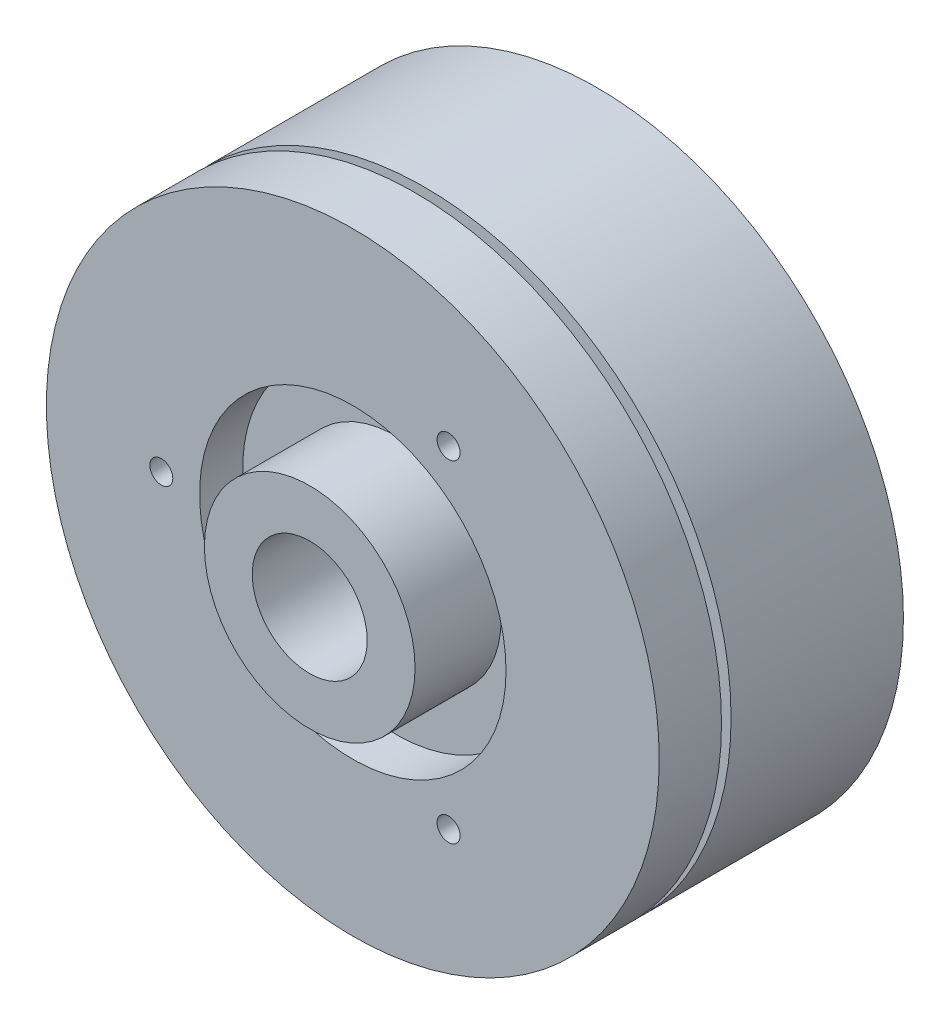
ISO-10303-21;
HEADER;
FILE_DESCRIPTION(('STEP AP214'),'2;1');
FILE_NAME('part.step','',(''),(''),'','','');
FILE_SCHEMA(('AUTOMOTIVE_DESIGN { 1 0 10303 214 1 1 1 1 }'));
ENDSEC;
DATA;
#1=APPLICATION_CONTEXT('core data for automotive mechanical design processes');
#2=APPLICATION_PROTOCOL_DEFINITION('international standard','automotive_design',2000,#1);
#3=PRODUCT_CONTEXT('',#1,'mechanical');
#4=PRODUCT('Part','Part','',(#3));
#5=PRODUCT_RELATED_PRODUCT_CATEGORY('part','',(#4));
#6=PRODUCT_DEFINITION_FORMATION('','',#4);
#7=PRODUCT_DEFINITION_CONTEXT('part definition',#1,'design');
#8=PRODUCT_DEFINITION('design','',#6,#7);
#9=PRODUCT_DEFINITION_SHAPE('','',#8);
#10=(LENGTH_UNIT() NAMED_UNIT(*) SI_UNIT(.MILLI.,.METRE.));
#11=(NAMED_UNIT(*) PLANE_ANGLE_UNIT() SI_UNIT($,.RADIAN.));
#12=(NAMED_UNIT(*) SI_UNIT($,.STERADIAN.) SOLID_ANGLE_UNIT());
#13=UNCERTAINTY_MEASURE_WITH_UNIT(LENGTH_MEASURE(1.E-05),#10,'distance_accuracy_value','');
#14=(GEOMETRIC_REPRESENTATION_CONTEXT(3) GLOBAL_UNCERTAINTY_ASSIGNED_CONTEXT((#13)) GLOBAL_UNIT_ASSIGNED_CONTEXT((#10,
#11,#12)) REPRESENTATION_CONTEXT('',''));
#15=CARTESIAN_POINT('',(0.,0.,0.));
#16=DIRECTION('',(0.,0.,1.));
#17=DIRECTION('',(1.,0.,0.));
#18=AXIS2_PLACEMENT_3D('',#15,#16,#17);
#19=CARTESIAN_POINT('',(0.,0.,9.));
#20=DIRECTION('',(0.,0.,-1.));
#21=DIRECTION('',(-1.,0.,0.));
#22=AXIS2_PLACEMENT_3D('',#19,#20,#21);
#23=CYLINDRICAL_SURFACE('',#22,16.);
#24=CARTESIAN_POINT('',(0.,0.,9.));
#25=DIRECTION('',(0.,0.,1.));
#26=DIRECTION('',(1.,0.,0.));
#27=AXIS2_PLACEMENT_3D('',#24,#25,#26);
#28=CIRCLE('',#27,16.);
#29=CARTESIAN_POINT('',(16.,0.,9.));
#30=VERTEX_POINT('',#29);
#31=EDGE_CURVE('E44',#30,#30,#28,.T.);
#32=ORIENTED_EDGE('',*,*,#31,.F.);
#33=EDGE_LOOP('',(#32));
#34=FACE_BOUND('',#33,.T.);
#35=CARTESIAN_POINT('',(0.,0.,0.));
#36=DIRECTION('',(0.,0.,1.));
#37=DIRECTION('',(1.,0.,0.));
#38=AXIS2_PLACEMENT_3D('',#35,#36,#37);
#39=CIRCLE('',#38,16.);
#40=CARTESIAN_POINT('',(16.,0.,0.));
#41=VERTEX_POINT('',#40);
#42=EDGE_CURVE('E39',#41,#41,#39,.T.);
#43=ORIENTED_EDGE('',*,*,#42,.T.);
#44=EDGE_LOOP('',(#43));
#45=FACE_BOUND('',#44,.T.);
#46=ADVANCED_FACE('F36',(#34,#45),#23,.T.);
#47=CARTESIAN_POINT('',(0.,0.,9.));
#48=DIRECTION('',(0.,0.,1.));
#49=DIRECTION('',(1.,0.,0.));
#50=AXIS2_PLACEMENT_3D('',#47,#48,#49);
#51=PLANE('',#50);
#52=CARTESIAN_POINT('',(0.,0.,9.));
#53=DIRECTION('',(0.,0.,1.));
#54=DIRECTION('',(1.,0.,0.));
#55=AXIS2_PLACEMENT_3D('',#52,#53,#54);
#56=CIRCLE('',#55,6.);
#57=CARTESIAN_POINT('',(6.,0.,9.));
#58=VERTEX_POINT('',#57);
#59=EDGE_CURVE('E10',#58,#58,#56,.T.);
#60=ORIENTED_EDGE('',*,*,#59,.F.);
#61=EDGE_LOOP('',(#60));
#62=FACE_BOUND('',#61,.T.);
#63=ORIENTED_EDGE('',*,*,#31,.T.);
#64=EDGE_LOOP('',(#63));
#65=FACE_BOUND('',#64,.T.);
#66=ADVANCED_FACE('F177',(#62,#65),#51,.T.);
#67=CARTESIAN_POINT('',(0.,0.,0.));
#68=DIRECTION('',(0.,0.,1.));
#69=DIRECTION('',(1.,0.,0.));
#70=AXIS2_PLACEMENT_3D('',#67,#68,#69);
#71=PLANE('',#70);
#72=CARTESIAN_POINT('',(-8.66025403784438,5.00000000000001,0.));
#73=DIRECTION('',(0.,0.,-1.));
#74=DIRECTION('',(-1.,0.,0.));
#75=AXIS2_PLACEMENT_3D('',#72,#73,#74);
#76=CIRCLE('',#75,0.6);
#77=CARTESIAN_POINT('',(-9.26025403784438,5.00000000000001,0.));
#78=VERTEX_POINT('',#77);
#79=EDGE_CURVE('E105',#78,#78,#76,.T.);
#80=ORIENTED_EDGE('',*,*,#79,.F.);
#81=EDGE_LOOP('',(#80));
#82=FACE_BOUND('',#81,.T.);
#83=CARTESIAN_POINT('',(8.66025403784442,4.99999999999995,0.));
#84=DIRECTION('',(0.,0.,-1.));
#85=DIRECTION('',(-1.,0.,0.));
#86=AXIS2_PLACEMENT_3D('',#83,#84,#85);
#87=CIRCLE('',#86,0.6);
#88=CARTESIAN_POINT('',(8.06025403784442,4.99999999999995,0.));
#89=VERTEX_POINT('',#88);
#90=EDGE_CURVE('E97',#89,#89,#87,.T.);
#91=ORIENTED_EDGE('',*,*,#90,.F.);
#92=EDGE_LOOP('',(#91));
#93=FACE_BOUND('',#92,.T.);
#94=CARTESIAN_POINT('',(0.,-10.,0.));
#95=DIRECTION('',(0.,0.,-1.));
#96=DIRECTION('',(-1.,0.,0.));
#97=AXIS2_PLACEMENT_3D('',#94,#95,#96);
#98=CIRCLE('',#97,0.6);
#99=CARTESIAN_POINT('',(-0.6,-10.,0.));
#100=VERTEX_POINT('',#99);
#101=EDGE_CURVE('E88',#100,#100,#98,.T.);
#102=ORIENTED_EDGE('',*,*,#101,.F.);
#103=EDGE_LOOP('',(#102));
#104=FACE_BOUND('',#103,.T.);
#105=CARTESIAN_POINT('',(0.,0.,0.));
#106=DIRECTION('',(0.,0.,1.));
#107=DIRECTION('',(1.,0.,0.));
#108=AXIS2_PLACEMENT_3D('',#105,#106,#107);
#109=CIRCLE('',#108,3.);
#110=CARTESIAN_POINT('',(3.,0.,0.));
#111=VERTEX_POINT('',#110);
#112=EDGE_CURVE('E67',#111,#111,#109,.T.);
#113=ORIENTED_EDGE('',*,*,#112,.T.);
#114=EDGE_LOOP('',(#113));
#115=FACE_BOUND('',#114,.T.);
#116=ORIENTED_EDGE('',*,*,#42,.F.);
#117=EDGE_LOOP('',(#116));
#118=FACE_BOUND('',#117,.T.);
#119=ADVANCED_FACE('F182',(#82,#93,#104,#115,#118),#71,.F.);
#120=CARTESIAN_POINT('',(0.,0.,9.5));
#121=DIRECTION('',(0.,0.,-1.));
#122=DIRECTION('',(-1.,0.,0.));
#123=AXIS2_PLACEMENT_3D('',#120,#121,#122);
#124=CYLINDRICAL_SURFACE('',#123,6.);
#125=CARTESIAN_POINT('',(0.,0.,9.5));
#126=DIRECTION('',(0.,0.,1.));
#127=DIRECTION('',(1.,0.,0.));
#128=AXIS2_PLACEMENT_3D('',#125,#126,#127);
#129=CIRCLE('',#128,6.);
#130=CARTESIAN_POINT('',(6.,0.,9.5));
#131=VERTEX_POINT('',#130);
#132=EDGE_CURVE('E51',#131,#131,#129,.T.);
#133=ORIENTED_EDGE('',*,*,#132,.F.);
#134=EDGE_LOOP('',(#133));
#135=FACE_BOUND('',#134,.T.);
#136=ORIENTED_EDGE('',*,*,#59,.T.);
#137=EDGE_LOOP('',(#136));
#138=FACE_BOUND('',#137,.T.);
#139=ADVANCED_FACE('F161',(#135,#138),#124,.T.);
#140=CARTESIAN_POINT('',(0.,0.,12.75));
#141=DIRECTION('',(0.,0.,-1.));
#142=DIRECTION('',(-1.,0.,0.));
#143=AXIS2_PLACEMENT_3D('',#140,#141,#142);
#144=CYLINDRICAL_SURFACE('',#143,16.);
#145=CARTESIAN_POINT('',(0.,0.,12.75));
#146=DIRECTION('',(0.,0.,1.));
#147=DIRECTION('',(1.,0.,0.));
#148=AXIS2_PLACEMENT_3D('',#145,#146,#147);
#149=CIRCLE('',#148,16.);
#150=CARTESIAN_POINT('',(16.,0.,12.75));
#151=VERTEX_POINT('',#150);
#152=EDGE_CURVE('E55',#151,#151,#149,.T.);
#153=ORIENTED_EDGE('',*,*,#152,.F.);
#154=EDGE_LOOP('',(#153));
#155=FACE_BOUND('',#154,.T.);
#156=CARTESIAN_POINT('',(0.,0.,9.5));
#157=DIRECTION('',(0.,0.,1.));
#158=DIRECTION('',(1.,0.,0.));
#159=AXIS2_PLACEMENT_3D('',#156,#157,#158);
#160=CIRCLE('',#159,16.);
#161=CARTESIAN_POINT('',(16.,0.,9.5));
#162=VERTEX_POINT('',#161);
#163=EDGE_CURVE('E56',#162,#162,#160,.T.);
#164=ORIENTED_EDGE('',*,*,#163,.T.);
#165=EDGE_LOOP('',(#164));
#166=FACE_BOUND('',#165,.T.);
#167=ADVANCED_FACE('F149',(#155,#166),#144,.T.);
#168=CARTESIAN_POINT('',(0.,0.,12.75));
#169=DIRECTION('',(0.,0.,1.));
#170=DIRECTION('',(1.,0.,0.));
#171=AXIS2_PLACEMENT_3D('',#168,#169,#170);
#172=PLANE('',#171);
#173=CARTESIAN_POINT('',(4.99999999999998,-8.6602540378444,12.75));
#174=DIRECTION('',(0.,0.,1.));
#175=DIRECTION('',(1.,0.,0.));
#176=AXIS2_PLACEMENT_3D('',#173,#174,#175);
#177=CIRCLE('',#176,0.6);
#178=CARTESIAN_POINT('',(5.59999999999998,-8.6602540378444,12.75));
#179=VERTEX_POINT('',#178);
#180=EDGE_CURVE('E128',#179,#179,#177,.T.);
#181=ORIENTED_EDGE('',*,*,#180,.F.);
#182=EDGE_LOOP('',(#181));
#183=FACE_BOUND('',#182,.T.);
#184=CARTESIAN_POINT('',(4.99999999999998,8.6602540378444,12.75));
#185=DIRECTION('',(0.,0.,1.));
#186=DIRECTION('',(1.,0.,0.));
#187=AXIS2_PLACEMENT_3D('',#184,#185,#186);
#188=CIRCLE('',#187,0.6);
#189=CARTESIAN_POINT('',(5.59999999999998,8.6602540378444,12.75));
#190=VERTEX_POINT('',#189);
#191=EDGE_CURVE('E120',#190,#190,#188,.T.);
#192=ORIENTED_EDGE('',*,*,#191,.F.);
#193=EDGE_LOOP('',(#192));
#194=FACE_BOUND('',#193,.T.);
#195=CARTESIAN_POINT('',(-10.,0.,12.75));
#196=DIRECTION('',(0.,0.,1.));
#197=DIRECTION('',(1.,0.,0.));
#198=AXIS2_PLACEMENT_3D('',#195,#196,#197);
#199=CIRCLE('',#198,0.6);
#200=CARTESIAN_POINT('',(-9.4,0.,12.75));
#201=VERTEX_POINT('',#200);
#202=EDGE_CURVE('E112',#201,#201,#199,.T.);
#203=ORIENTED_EDGE('',*,*,#202,.F.);
#204=EDGE_LOOP('',(#203));
#205=FACE_BOUND('',#204,.T.);
#206=CARTESIAN_POINT('',(0.,0.,12.75));
#207=DIRECTION('',(0.,0.,1.));
#208=DIRECTION('',(1.,0.,0.));
#209=AXIS2_PLACEMENT_3D('',#206,#207,#208);
#210=CIRCLE('',#209,8.);
#211=CARTESIAN_POINT('',(8.,0.,12.75));
#212=VERTEX_POINT('',#211);
#213=EDGE_CURVE('E76',#212,#212,#210,.T.);
#214=ORIENTED_EDGE('',*,*,#213,.F.);
#215=EDGE_LOOP('',(#214));
#216=FACE_BOUND('',#215,.T.);
#217=ORIENTED_EDGE('',*,*,#152,.T.);
#218=EDGE_LOOP('',(#217));
#219=FACE_BOUND('',#218,.T.);
#220=ADVANCED_FACE('F145',(#183,#194,#205,#216,#219),#172,.T.);
#221=CARTESIAN_POINT('',(0.,0.,9.5));
#222=DIRECTION('',(0.,0.,1.));
#223=DIRECTION('',(1.,0.,0.));
#224=AXIS2_PLACEMENT_3D('',#221,#222,#223);
#225=PLANE('',#224);
#226=ORIENTED_EDGE('',*,*,#132,.T.);
#227=EDGE_LOOP('',(#226));
#228=FACE_BOUND('',#227,.T.);
#229=ORIENTED_EDGE('',*,*,#163,.F.);
#230=EDGE_LOOP('',(#229));
#231=FACE_BOUND('',#230,.T.);
#232=ADVANCED_FACE('F148',(#228,#231),#225,.F.);
#233=CARTESIAN_POINT('',(0.,0.,15.));
#234=DIRECTION('',(0.,0.,-1.));
#235=DIRECTION('',(-1.,0.,0.));
#236=AXIS2_PLACEMENT_3D('',#233,#234,#235);
#237=CYLINDRICAL_SURFACE('',#236,5.5);
#238=CARTESIAN_POINT('',(0.,0.,15.));
#239=DIRECTION('',(0.,0.,1.));
#240=DIRECTION('',(1.,0.,0.));
#241=AXIS2_PLACEMENT_3D('',#238,#239,#240);
#242=CIRCLE('',#241,5.5);
#243=CARTESIAN_POINT('',(5.5,0.,15.));
#244=VERTEX_POINT('',#243);
#245=EDGE_CURVE('E60',#244,#244,#242,.T.);
#246=ORIENTED_EDGE('',*,*,#245,.F.);
#247=EDGE_LOOP('',(#246));
#248=FACE_BOUND('',#247,.T.);
#249=CARTESIAN_POINT('',(0.,0.,10.5));
#250=DIRECTION('',(0.,0.,1.));
#251=DIRECTION('',(1.,0.,0.));
#252=AXIS2_PLACEMENT_3D('',#249,#250,#251);
#253=CIRCLE('',#252,5.5);
#254=CARTESIAN_POINT('',(5.5,0.,10.5));
#255=VERTEX_POINT('',#254);
#256=EDGE_CURVE('E80',#255,#255,#253,.T.);
#257=ORIENTED_EDGE('',*,*,#256,.T.);
#258=EDGE_LOOP('',(#257));
#259=FACE_BOUND('',#258,.T.);
#260=ADVANCED_FACE('F166',(#248,#259),#237,.T.);
#261=CARTESIAN_POINT('',(0.,0.,15.));
#262=DIRECTION('',(0.,0.,1.));
#263=DIRECTION('',(1.,0.,0.));
#264=AXIS2_PLACEMENT_3D('',#261,#262,#263);
#265=PLANE('',#264);
#266=CARTESIAN_POINT('',(0.,0.,15.));
#267=DIRECTION('',(0.,0.,1.));
#268=DIRECTION('',(1.,0.,0.));
#269=AXIS2_PLACEMENT_3D('',#266,#267,#268);
#270=CIRCLE('',#269,3.);
#271=CARTESIAN_POINT('',(3.,0.,15.));
#272=VERTEX_POINT('',#271);
#273=EDGE_CURVE('E71',#272,#272,#270,.T.);
#274=ORIENTED_EDGE('',*,*,#273,.F.);
#275=EDGE_LOOP('',(#274));
#276=FACE_BOUND('',#275,.T.);
#277=ORIENTED_EDGE('',*,*,#245,.T.);
#278=EDGE_LOOP('',(#277));
#279=FACE_BOUND('',#278,.T.);
#280=ADVANCED_FACE('F173',(#276,#279),#265,.T.);
#281=CARTESIAN_POINT('',(0.,0.,-11.25));
#282=DIRECTION('',(0.,0.,1.));
#283=DIRECTION('',(1.,0.,0.));
#284=AXIS2_PLACEMENT_3D('',#281,#282,#283);
#285=CYLINDRICAL_SURFACE('',#284,3.);
#286=ORIENTED_EDGE('',*,*,#273,.T.);
#287=EDGE_LOOP('',(#286));
#288=FACE_BOUND('',#287,.T.);
#289=ORIENTED_EDGE('',*,*,#112,.F.);
#290=EDGE_LOOP('',(#289));
#291=FACE_BOUND('',#290,.T.);
#292=ADVANCED_FACE('F208',(#288,#291),#285,.F.);
#293=CARTESIAN_POINT('',(0.,0.,10.5));
#294=DIRECTION('',(0.,0.,1.));
#295=DIRECTION('',(1.,0.,0.));
#296=AXIS2_PLACEMENT_3D('',#293,#294,#295);
#297=CYLINDRICAL_SURFACE('',#296,8.);
#298=CARTESIAN_POINT('',(0.,0.,10.5));
#299=DIRECTION('',(0.,0.,1.));
#300=DIRECTION('',(1.,0.,0.));
#301=AXIS2_PLACEMENT_3D('',#298,#299,#300);
#302=CIRCLE('',#301,8.);
#303=CARTESIAN_POINT('',(8.,0.,10.5));
#304=VERTEX_POINT('',#303);
#305=EDGE_CURVE('E75',#304,#304,#302,.T.);
#306=ORIENTED_EDGE('',*,*,#305,.F.);
#307=EDGE_LOOP('',(#306));
#308=FACE_BOUND('',#307,.T.);
#309=ORIENTED_EDGE('',*,*,#213,.T.);
#310=EDGE_LOOP('',(#309));
#311=FACE_BOUND('',#310,.T.);
#312=ADVANCED_FACE('F210',(#308,#311),#297,.F.);
#313=CARTESIAN_POINT('',(0.,0.,10.5));
#314=DIRECTION('',(0.,0.,1.));
#315=DIRECTION('',(1.,0.,0.));
#316=AXIS2_PLACEMENT_3D('',#313,#314,#315);
#317=PLANE('',#316);
#318=ORIENTED_EDGE('',*,*,#256,.F.);
#319=EDGE_LOOP('',(#318));
#320=FACE_BOUND('',#319,.T.);
#321=ORIENTED_EDGE('',*,*,#305,.T.);
#322=EDGE_LOOP('',(#321));
#323=FACE_BOUND('',#322,.T.);
#324=ADVANCED_FACE('F217',(#320,#323),#317,.T.);
#325=CARTESIAN_POINT('',(0.,-10.,6.));
#326=DIRECTION('',(0.,0.,-1.));
#327=DIRECTION('',(-1.,0.,0.));
#328=AXIS2_PLACEMENT_3D('',#325,#326,#327);
#329=CYLINDRICAL_SURFACE('',#328,0.6);
#330=CARTESIAN_POINT('',(0.,-10.,6.));
#331=DIRECTION('',(0.,0.,-1.));
#332=DIRECTION('',(-1.,0.,0.));
#333=AXIS2_PLACEMENT_3D('',#330,#331,#332);
#334=CIRCLE('',#333,0.6);
#335=CARTESIAN_POINT('',(-0.6,-10.,6.));
#336=VERTEX_POINT('',#335);
#337=EDGE_CURVE('E92',#336,#336,#334,.T.);
#338=ORIENTED_EDGE('',*,*,#337,.F.);
#339=EDGE_LOOP('',(#338));
#340=FACE_BOUND('',#339,.T.);
#341=ORIENTED_EDGE('',*,*,#101,.T.);
#342=EDGE_LOOP('',(#341));
#343=FACE_BOUND('',#342,.T.);
#344=ADVANCED_FACE('F225',(#340,#343),#329,.F.);
#345=CARTESIAN_POINT('',(0.,-10.,6.));
#346=DIRECTION('',(0.,0.,-1.));
#347=DIRECTION('',(-1.,0.,0.));
#348=AXIS2_PLACEMENT_3D('',#345,#346,#347);
#349=PLANE('',#348);
#350=ORIENTED_EDGE('',*,*,#337,.T.);
#351=EDGE_LOOP('',(#350));
#352=FACE_BOUND('',#351,.T.);
#353=ADVANCED_FACE('F229',(#352),#349,.T.);
#354=CARTESIAN_POINT('',(8.66025403784442,4.99999999999995,6.));
#355=DIRECTION('',(0.,0.,-1.));
#356=DIRECTION('',(-1.,0.,0.));
#357=AXIS2_PLACEMENT_3D('',#354,#355,#356);
#358=CYLINDRICAL_SURFACE('',#357,0.6);
#359=CARTESIAN_POINT('',(8.66025403784442,4.99999999999995,6.));
#360=DIRECTION('',(0.,0.,-1.));
#361=DIRECTION('',(-1.,0.,0.));
#362=AXIS2_PLACEMENT_3D('',#359,#360,#361);
#363=CIRCLE('',#362,0.6);
#364=CARTESIAN_POINT('',(8.06025403784442,4.99999999999995,6.));
#365=VERTEX_POINT('',#364);
#366=EDGE_CURVE('E101',#365,#365,#363,.T.);
#367=ORIENTED_EDGE('',*,*,#366,.F.);
#368=EDGE_LOOP('',(#367));
#369=FACE_BOUND('',#368,.T.);
#370=ORIENTED_EDGE('',*,*,#90,.T.);
#371=EDGE_LOOP('',(#370));
#372=FACE_BOUND('',#371,.T.);
#373=ADVANCED_FACE('F233',(#369,#372),#358,.F.);
#374=CARTESIAN_POINT('',(8.66025403784442,4.99999999999995,6.));
#375=DIRECTION('',(0.,0.,-1.));
#376=DIRECTION('',(-1.,0.,0.));
#377=AXIS2_PLACEMENT_3D('',#374,#375,#376);
#378=PLANE('',#377);
#379=ORIENTED_EDGE('',*,*,#366,.T.);
#380=EDGE_LOOP('',(#379));
#381=FACE_BOUND('',#380,.T.);
#382=ADVANCED_FACE('F237',(#381),#378,.T.);
#383=CARTESIAN_POINT('',(-8.66025403784438,5.00000000000001,6.));
#384=DIRECTION('',(0.,0.,-1.));
#385=DIRECTION('',(-1.,0.,0.));
#386=AXIS2_PLACEMENT_3D('',#383,#384,#385);
#387=CYLINDRICAL_SURFACE('',#386,0.6);
#388=CARTESIAN_POINT('',(-8.66025403784438,5.00000000000001,6.));
#389=DIRECTION('',(0.,0.,-1.));
#390=DIRECTION('',(-1.,0.,0.));
#391=AXIS2_PLACEMENT_3D('',#388,#389,#390);
#392=CIRCLE('',#391,0.6);
#393=CARTESIAN_POINT('',(-9.26025403784438,5.00000000000001,6.));
#394=VERTEX_POINT('',#393);
#395=EDGE_CURVE('E87',#394,#394,#392,.T.);
#396=ORIENTED_EDGE('',*,*,#395,.F.);
#397=EDGE_LOOP('',(#396));
#398=FACE_BOUND('',#397,.T.);
#399=ORIENTED_EDGE('',*,*,#79,.T.);
#400=EDGE_LOOP('',(#399));
#401=FACE_BOUND('',#400,.T.);
#402=ADVANCED_FACE('F241',(#398,#401),#387,.F.);
#403=CARTESIAN_POINT('',(-8.66025403784438,5.00000000000001,6.));
#404=DIRECTION('',(0.,0.,-1.));
#405=DIRECTION('',(-1.,0.,0.));
#406=AXIS2_PLACEMENT_3D('',#403,#404,#405);
#407=PLANE('',#406);
#408=ORIENTED_EDGE('',*,*,#395,.T.);
#409=EDGE_LOOP('',(#408));
#410=FACE_BOUND('',#409,.T.);
#411=ADVANCED_FACE('F245',(#410),#407,.T.);
#412=CARTESIAN_POINT('',(-10.,0.,9.75));
#413=DIRECTION('',(0.,0.,1.));
#414=DIRECTION('',(1.,0.,0.));
#415=AXIS2_PLACEMENT_3D('',#412,#413,#414);
#416=CYLINDRICAL_SURFACE('',#415,0.6);
#417=CARTESIAN_POINT('',(-10.,0.,9.75));
#418=DIRECTION('',(0.,0.,1.));
#419=DIRECTION('',(1.,0.,0.));
#420=AXIS2_PLACEMENT_3D('',#417,#418,#419);
#421=CIRCLE('',#420,0.6);
#422=CARTESIAN_POINT('',(-9.4,0.,9.75));
#423=VERTEX_POINT('',#422);
#424=EDGE_CURVE('E116',#423,#423,#421,.T.);
#425=ORIENTED_EDGE('',*,*,#424,.F.);
#426=EDGE_LOOP('',(#425));
#427=FACE_BOUND('',#426,.T.);
#428=ORIENTED_EDGE('',*,*,#202,.T.);
#429=EDGE_LOOP('',(#428));
#430=FACE_BOUND('',#429,.T.);
#431=ADVANCED_FACE('F249',(#427,#430),#416,.F.);
#432=CARTESIAN_POINT('',(-10.,0.,9.75));
#433=DIRECTION('',(0.,0.,1.));
#434=DIRECTION('',(1.,0.,0.));
#435=AXIS2_PLACEMENT_3D('',#432,#433,#434);
#436=PLANE('',#435);
#437=ORIENTED_EDGE('',*,*,#424,.T.);
#438=EDGE_LOOP('',(#437));
#439=FACE_BOUND('',#438,.T.);
#440=ADVANCED_FACE('F253',(#439),#436,.T.);
#441=CARTESIAN_POINT('',(4.99999999999998,8.6602540378444,9.75));
#442=DIRECTION('',(0.,0.,1.));
#443=DIRECTION('',(1.,0.,0.));
#444=AXIS2_PLACEMENT_3D('',#441,#442,#443);
#445=CYLINDRICAL_SURFACE('',#444,0.6);
#446=CARTESIAN_POINT('',(4.99999999999998,8.6602540378444,9.75));
#447=DIRECTION('',(0.,0.,1.));
#448=DIRECTION('',(1.,0.,0.));
#449=AXIS2_PLACEMENT_3D('',#446,#447,#448);
#450=CIRCLE('',#449,0.6);
#451=CARTESIAN_POINT('',(5.59999999999998,8.6602540378444,9.75));
#452=VERTEX_POINT('',#451);
#453=EDGE_CURVE('E124',#452,#452,#450,.T.);
#454=ORIENTED_EDGE('',*,*,#453,.F.);
#455=EDGE_LOOP('',(#454));
#456=FACE_BOUND('',#455,.T.);
#457=ORIENTED_EDGE('',*,*,#191,.T.);
#458=EDGE_LOOP('',(#457));
#459=FACE_BOUND('',#458,.T.);
#460=ADVANCED_FACE('F257',(#456,#459),#445,.F.);
#461=CARTESIAN_POINT('',(4.99999999999998,8.6602540378444,9.75));
#462=DIRECTION('',(0.,0.,1.));
#463=DIRECTION('',(1.,0.,0.));
#464=AXIS2_PLACEMENT_3D('',#461,#462,#463);
#465=PLANE('',#464);
#466=ORIENTED_EDGE('',*,*,#453,.T.);
#467=EDGE_LOOP('',(#466));
#468=FACE_BOUND('',#467,.T.);
#469=ADVANCED_FACE('F141',(#468),#465,.T.);
#470=CARTESIAN_POINT('',(4.99999999999998,-8.6602540378444,9.75));
#471=DIRECTION('',(0.,0.,1.));
#472=DIRECTION('',(1.,0.,0.));
#473=AXIS2_PLACEMENT_3D('',#470,#471,#472);
#474=CYLINDRICAL_SURFACE('',#473,0.6);
#475=CARTESIAN_POINT('',(4.99999999999998,-8.6602540378444,9.75));
#476=DIRECTION('',(0.,0.,1.));
#477=DIRECTION('',(1.,0.,0.));
#478=AXIS2_PLACEMENT_3D('',#475,#476,#477);
#479=CIRCLE('',#478,0.6);
#480=CARTESIAN_POINT('',(5.59999999999998,-8.6602540378444,9.75));
#481=VERTEX_POINT('',#480);
#482=EDGE_CURVE('E93',#481,#481,#479,.T.);
#483=ORIENTED_EDGE('',*,*,#482,.F.);
#484=EDGE_LOOP('',(#483));
#485=FACE_BOUND('',#484,.T.);
#486=ORIENTED_EDGE('',*,*,#180,.T.);
#487=EDGE_LOOP('',(#486));
#488=FACE_BOUND('',#487,.T.);
#489=ADVANCED_FACE('F138',(#485,#488),#474,.F.);
#490=CARTESIAN_POINT('',(4.99999999999998,-8.6602540378444,9.75));
#491=DIRECTION('',(0.,0.,1.));
#492=DIRECTION('',(1.,0.,0.));
#493=AXIS2_PLACEMENT_3D('',#490,#491,#492);
#494=PLANE('',#493);
#495=ORIENTED_EDGE('',*,*,#482,.T.);
#496=EDGE_LOOP('',(#495));
#497=FACE_BOUND('',#496,.T.);
#498=ADVANCED_FACE('F136',(#497),#494,.T.);
#499=CLOSED_SHELL('',(#46,#66,#119,#139,#167,#220,#232,#260,#280,#292,#312,#324,#344,#353,#373,
#382,#402,#411,#431,#440,#460,#469,#489,#498));
#500=MANIFOLD_SOLID_BREP('B2',#499);
#501=ADVANCED_BREP_SHAPE_REPRESENTATION('',(#18,#500),#14);
#502=SHAPE_DEFINITION_REPRESENTATION(#9,#501);
ENDSEC;
END-ISO-10303-21;
